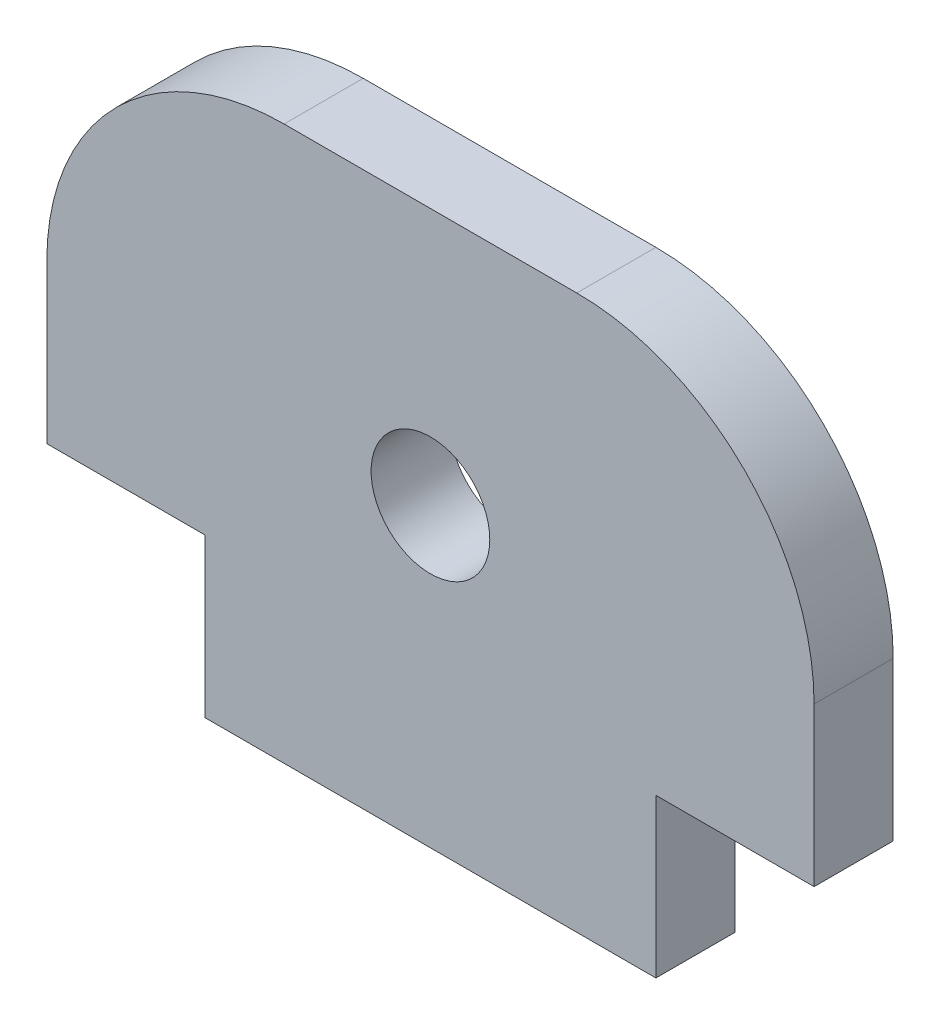
ISO-10303-21;
HEADER;
FILE_DESCRIPTION(('STEP AP214'),'2;1');
FILE_NAME('part.step','',(''),(''),'','','');
FILE_SCHEMA(('AUTOMOTIVE_DESIGN { 1 0 10303 214 1 1 1 1 }'));
ENDSEC;
DATA;
#1=APPLICATION_CONTEXT('core data for automotive mechanical design processes');
#2=APPLICATION_PROTOCOL_DEFINITION('international standard','automotive_design',2000,#1);
#3=PRODUCT_CONTEXT('',#1,'mechanical');
#4=PRODUCT('Part','Part','',(#3));
#5=PRODUCT_RELATED_PRODUCT_CATEGORY('part','',(#4));
#6=PRODUCT_DEFINITION_FORMATION('','',#4);
#7=PRODUCT_DEFINITION_CONTEXT('part definition',#1,'design');
#8=PRODUCT_DEFINITION('design','',#6,#7);
#9=PRODUCT_DEFINITION_SHAPE('','',#8);
#10=(LENGTH_UNIT() NAMED_UNIT(*) SI_UNIT(.MILLI.,.METRE.));
#11=(NAMED_UNIT(*) PLANE_ANGLE_UNIT() SI_UNIT($,.RADIAN.));
#12=(NAMED_UNIT(*) SI_UNIT($,.STERADIAN.) SOLID_ANGLE_UNIT());
#13=UNCERTAINTY_MEASURE_WITH_UNIT(LENGTH_MEASURE(1.E-05),#10,'distance_accuracy_value','');
#14=(GEOMETRIC_REPRESENTATION_CONTEXT(3) GLOBAL_UNCERTAINTY_ASSIGNED_CONTEXT((#13)) GLOBAL_UNIT_ASSIGNED_CONTEXT((#10,
#11,#12)) REPRESENTATION_CONTEXT('',''));
#15=CARTESIAN_POINT('',(0.,0.,0.));
#16=DIRECTION('',(0.,0.,1.));
#17=DIRECTION('',(1.,0.,0.));
#18=AXIS2_PLACEMENT_3D('',#15,#16,#17);
#19=CARTESIAN_POINT('',(3.70000000000026,0.499999999999501,2.));
#20=DIRECTION('',(0.,0.,1.));
#21=DIRECTION('',(1.,0.,0.));
#22=AXIS2_PLACEMENT_3D('',#19,#20,#21);
#23=PLANE('',#22);
#24=CARTESIAN_POINT('',(3.70000000000026,0.499999999999501,2.));
#25=DIRECTION('',(0.,0.,1.));
#26=DIRECTION('',(1.,0.,0.));
#27=AXIS2_PLACEMENT_3D('',#24,#25,#26);
#28=CIRCLE('',#27,5.99999999999989);
#29=CARTESIAN_POINT('',(9.70000000000015,0.499999999999501,2.));
#30=VERTEX_POINT('',#29);
#31=CARTESIAN_POINT('',(3.70000000000026,6.4999999999994,2.));
#32=VERTEX_POINT('',#31);
#33=EDGE_CURVE('E160',#30,#32,#28,.T.);
#34=ORIENTED_EDGE('',*,*,#33,.T.);
#35=DIRECTION('',(-1.,0.,0.));
#36=VECTOR('',#35,1.);
#37=CARTESIAN_POINT('',(-3.7000000000007,6.49999999999951,2.));
#38=LINE('',#37,#36);
#39=CARTESIAN_POINT('',(-3.7000000000007,6.4999999999994,2.));
#40=VERTEX_POINT('',#39);
#41=EDGE_CURVE('E98',#32,#40,#38,.T.);
#42=ORIENTED_EDGE('',*,*,#41,.T.);
#43=CARTESIAN_POINT('',(-3.7000000000007,0.499999999999501,2.));
#44=DIRECTION('',(0.,0.,1.));
#45=DIRECTION('',(1.,0.,0.));
#46=AXIS2_PLACEMENT_3D('',#43,#44,#45);
#47=CIRCLE('',#46,5.99999999999989);
#48=CARTESIAN_POINT('',(-9.70000000000049,0.499999999999501,2.));
#49=VERTEX_POINT('',#48);
#50=EDGE_CURVE('E181',#40,#49,#47,.T.);
#51=ORIENTED_EDGE('',*,*,#50,.T.);
#52=DIRECTION('',(0.,-1.,0.));
#53=VECTOR('',#52,1.);
#54=CARTESIAN_POINT('',(-9.70000000000049,-3.5000000000005,2.));
#55=LINE('',#54,#53);
#56=CARTESIAN_POINT('',(-9.70000000000049,-3.5000000000005,2.));
#57=VERTEX_POINT('',#56);
#58=EDGE_CURVE('E200',#49,#57,#55,.T.);
#59=ORIENTED_EDGE('',*,*,#58,.T.);
#60=DIRECTION('',(1.,0.,0.));
#61=VECTOR('',#60,1.);
#62=CARTESIAN_POINT('',(-9.70000000000049,-3.5000000000005,2.));
#63=LINE('',#62,#61);
#64=CARTESIAN_POINT('',(-5.70000000000048,-3.5000000000005,2.));
#65=VERTEX_POINT('',#64);
#66=EDGE_CURVE('E197',#57,#65,#63,.T.);
#67=ORIENTED_EDGE('',*,*,#66,.T.);
#68=DIRECTION('',(0.,-1.,0.));
#69=VECTOR('',#68,1.);
#70=CARTESIAN_POINT('',(-5.70000000000048,-7.50000000000051,2.));
#71=LINE('',#70,#69);
#72=CARTESIAN_POINT('',(-5.70000000000048,-7.50000000000051,2.));
#73=VERTEX_POINT('',#72);
#74=EDGE_CURVE('E199',#65,#73,#71,.T.);
#75=ORIENTED_EDGE('',*,*,#74,.T.);
#76=DIRECTION('',(1.,0.,0.));
#77=VECTOR('',#76,1.);
#78=CARTESIAN_POINT('',(5.70000000000004,-7.50000000000051,2.));
#79=LINE('',#78,#77);
#80=CARTESIAN_POINT('',(5.70000000000004,-7.50000000000051,2.));
#81=VERTEX_POINT('',#80);
#82=EDGE_CURVE('E123',#73,#81,#79,.T.);
#83=ORIENTED_EDGE('',*,*,#82,.T.);
#84=DIRECTION('',(0.,1.,0.));
#85=VECTOR('',#84,1.);
#86=CARTESIAN_POINT('',(5.70000000000004,-3.5000000000005,2.));
#87=LINE('',#86,#85);
#88=CARTESIAN_POINT('',(5.70000000000004,-3.5000000000005,2.));
#89=VERTEX_POINT('',#88);
#90=EDGE_CURVE('E117',#81,#89,#87,.T.);
#91=ORIENTED_EDGE('',*,*,#90,.T.);
#92=DIRECTION('',(1.,0.,0.));
#93=VECTOR('',#92,1.);
#94=CARTESIAN_POINT('',(9.70000000000015,-3.5000000000005,2.));
#95=LINE('',#94,#93);
#96=CARTESIAN_POINT('',(9.70000000000015,-3.5000000000005,2.));
#97=VERTEX_POINT('',#96);
#98=EDGE_CURVE('E121',#89,#97,#95,.T.);
#99=ORIENTED_EDGE('',*,*,#98,.T.);
#100=DIRECTION('',(0.,1.,0.));
#101=VECTOR('',#100,1.);
#102=CARTESIAN_POINT('',(9.70000000000015,-3.5000000000005,2.));
#103=LINE('',#102,#101);
#104=EDGE_CURVE('E49',#97,#30,#103,.T.);
#105=ORIENTED_EDGE('',*,*,#104,.T.);
#106=EDGE_LOOP('',(#34,#42,#51,#59,#67,#75,#83,#91,#99,#105));
#107=FACE_BOUND('',#106,.T.);
#108=CARTESIAN_POINT('',(0.,0.,2.));
#109=DIRECTION('',(0.,0.,1.));
#110=DIRECTION('',(1.,0.,0.));
#111=AXIS2_PLACEMENT_3D('',#108,#109,#110);
#112=CIRCLE('',#111,1.50000000000006);
#113=CARTESIAN_POINT('',(1.50000000000006,0.,2.));
#114=VERTEX_POINT('',#113);
#115=EDGE_CURVE('E145',#114,#114,#112,.T.);
#116=ORIENTED_EDGE('',*,*,#115,.F.);
#117=EDGE_LOOP('',(#116));
#118=FACE_BOUND('',#117,.T.);
#119=ADVANCED_FACE('F32',(#107,#118),#23,.T.);
#120=CARTESIAN_POINT('',(3.70000000000026,0.499999999999501,0.));
#121=DIRECTION('',(0.,0.,1.));
#122=DIRECTION('',(1.,0.,0.));
#123=AXIS2_PLACEMENT_3D('',#120,#121,#122);
#124=PLANE('',#123);
#125=CARTESIAN_POINT('',(3.70000000000026,0.499999999999501,0.));
#126=DIRECTION('',(0.,0.,1.));
#127=DIRECTION('',(1.,0.,0.));
#128=AXIS2_PLACEMENT_3D('',#125,#126,#127);
#129=CIRCLE('',#128,5.99999999999989);
#130=CARTESIAN_POINT('',(9.70000000000015,0.499999999999501,0.));
#131=VERTEX_POINT('',#130);
#132=CARTESIAN_POINT('',(3.70000000000026,6.4999999999994,0.));
#133=VERTEX_POINT('',#132);
#134=EDGE_CURVE('E141',#131,#133,#129,.T.);
#135=ORIENTED_EDGE('',*,*,#134,.F.);
#136=DIRECTION('',(0.,1.,0.));
#137=VECTOR('',#136,1.);
#138=CARTESIAN_POINT('',(9.70000000000015,-3.5000000000005,0.));
#139=LINE('',#138,#137);
#140=CARTESIAN_POINT('',(9.70000000000015,-3.5000000000005,0.));
#141=VERTEX_POINT('',#140);
#142=EDGE_CURVE('E90',#141,#131,#139,.T.);
#143=ORIENTED_EDGE('',*,*,#142,.F.);
#144=DIRECTION('',(1.,0.,0.));
#145=VECTOR('',#144,1.);
#146=CARTESIAN_POINT('',(9.70000000000015,-3.5000000000005,0.));
#147=LINE('',#146,#145);
#148=CARTESIAN_POINT('',(5.70000000000004,-3.5000000000005,0.));
#149=VERTEX_POINT('',#148);
#150=EDGE_CURVE('E84',#149,#141,#147,.T.);
#151=ORIENTED_EDGE('',*,*,#150,.F.);
#152=DIRECTION('',(0.,1.,0.));
#153=VECTOR('',#152,1.);
#154=CARTESIAN_POINT('',(5.70000000000004,-3.5000000000005,0.));
#155=LINE('',#154,#153);
#156=CARTESIAN_POINT('',(5.70000000000004,-7.50000000000051,0.));
#157=VERTEX_POINT('',#156);
#158=EDGE_CURVE('E131',#157,#149,#155,.T.);
#159=ORIENTED_EDGE('',*,*,#158,.F.);
#160=DIRECTION('',(1.,0.,0.));
#161=VECTOR('',#160,1.);
#162=CARTESIAN_POINT('',(5.70000000000004,-7.50000000000051,0.));
#163=LINE('',#162,#161);
#164=CARTESIAN_POINT('',(-5.70000000000048,-7.50000000000051,0.));
#165=VERTEX_POINT('',#164);
#166=EDGE_CURVE('E155',#165,#157,#163,.T.);
#167=ORIENTED_EDGE('',*,*,#166,.F.);
#168=DIRECTION('',(0.,-1.,0.));
#169=VECTOR('',#168,1.);
#170=CARTESIAN_POINT('',(-5.70000000000048,-7.50000000000051,0.));
#171=LINE('',#170,#169);
#172=CARTESIAN_POINT('',(-5.70000000000048,-3.5000000000005,0.));
#173=VERTEX_POINT('',#172);
#174=EDGE_CURVE('E153',#173,#165,#171,.T.);
#175=ORIENTED_EDGE('',*,*,#174,.F.);
#176=DIRECTION('',(1.,0.,0.));
#177=VECTOR('',#176,1.);
#178=CARTESIAN_POINT('',(-9.70000000000049,-3.5000000000005,0.));
#179=LINE('',#178,#177);
#180=CARTESIAN_POINT('',(-9.70000000000049,-3.5000000000005,0.));
#181=VERTEX_POINT('',#180);
#182=EDGE_CURVE('E151',#181,#173,#179,.T.);
#183=ORIENTED_EDGE('',*,*,#182,.F.);
#184=DIRECTION('',(0.,-1.,0.));
#185=VECTOR('',#184,1.);
#186=CARTESIAN_POINT('',(-9.70000000000049,-3.5000000000005,0.));
#187=LINE('',#186,#185);
#188=CARTESIAN_POINT('',(-9.70000000000049,0.499999999999501,0.));
#189=VERTEX_POINT('',#188);
#190=EDGE_CURVE('E149',#189,#181,#187,.T.);
#191=ORIENTED_EDGE('',*,*,#190,.F.);
#192=CARTESIAN_POINT('',(-3.7000000000007,0.499999999999501,0.));
#193=DIRECTION('',(0.,0.,1.));
#194=DIRECTION('',(1.,0.,0.));
#195=AXIS2_PLACEMENT_3D('',#192,#193,#194);
#196=CIRCLE('',#195,5.99999999999989);
#197=CARTESIAN_POINT('',(-3.7000000000007,6.4999999999994,0.));
#198=VERTEX_POINT('',#197);
#199=EDGE_CURVE('E147',#198,#189,#196,.T.);
#200=ORIENTED_EDGE('',*,*,#199,.F.);
#201=DIRECTION('',(-1.,0.,0.));
#202=VECTOR('',#201,1.);
#203=CARTESIAN_POINT('',(-3.7000000000007,6.49999999999951,0.));
#204=LINE('',#203,#202);
#205=EDGE_CURVE('E144',#133,#198,#204,.T.);
#206=ORIENTED_EDGE('',*,*,#205,.F.);
#207=EDGE_LOOP('',(#135,#143,#151,#159,#167,#175,#183,#191,#200,#206));
#208=FACE_BOUND('',#207,.T.);
#209=CARTESIAN_POINT('',(0.,0.,0.));
#210=DIRECTION('',(0.,0.,1.));
#211=DIRECTION('',(1.,0.,0.));
#212=AXIS2_PLACEMENT_3D('',#209,#210,#211);
#213=CIRCLE('',#212,1.50000000000006);
#214=CARTESIAN_POINT('',(1.50000000000006,0.,0.));
#215=VERTEX_POINT('',#214);
#216=EDGE_CURVE('E208',#215,#215,#213,.T.);
#217=ORIENTED_EDGE('',*,*,#216,.T.);
#218=EDGE_LOOP('',(#217));
#219=FACE_BOUND('',#218,.T.);
#220=ADVANCED_FACE('F185',(#208,#219),#124,.F.);
#221=CARTESIAN_POINT('',(3.70000000000026,0.499999999999501,2.));
#222=DIRECTION('',(0.,0.,-1.));
#223=DIRECTION('',(-1.,0.,0.));
#224=AXIS2_PLACEMENT_3D('',#221,#222,#223);
#225=CYLINDRICAL_SURFACE('',#224,5.99999999999989);
#226=ORIENTED_EDGE('',*,*,#134,.T.);
#227=DIRECTION('',(0.,0.,-1.));
#228=VECTOR('',#227,1.);
#229=CARTESIAN_POINT('',(3.70000000000026,6.4999999999994,2.));
#230=LINE('',#229,#228);
#231=EDGE_CURVE('E11',#32,#133,#230,.T.);
#232=ORIENTED_EDGE('',*,*,#231,.F.);
#233=ORIENTED_EDGE('',*,*,#33,.F.);
#234=DIRECTION('',(0.,0.,-1.));
#235=VECTOR('',#234,1.);
#236=CARTESIAN_POINT('',(9.70000000000015,0.499999999999501,2.));
#237=LINE('',#236,#235);
#238=EDGE_CURVE('E137',#30,#131,#237,.T.);
#239=ORIENTED_EDGE('',*,*,#238,.T.);
#240=EDGE_LOOP('',(#226,#232,#233,#239));
#241=FACE_BOUND('',#240,.T.);
#242=ADVANCED_FACE('F34',(#241),#225,.T.);
#243=CARTESIAN_POINT('',(-3.7000000000007,6.49999999999951,2.));
#244=DIRECTION('',(0.,-1.,0.));
#245=DIRECTION('',(1.,0.,0.));
#246=AXIS2_PLACEMENT_3D('',#243,#244,#245);
#247=PLANE('',#246);
#248=ORIENTED_EDGE('',*,*,#205,.T.);
#249=DIRECTION('',(0.,0.,-1.));
#250=VECTOR('',#249,1.);
#251=CARTESIAN_POINT('',(-3.7000000000007,6.4999999999994,2.));
#252=LINE('',#251,#250);
#253=EDGE_CURVE('E41',#40,#198,#252,.T.);
#254=ORIENTED_EDGE('',*,*,#253,.F.);
#255=ORIENTED_EDGE('',*,*,#41,.F.);
#256=ORIENTED_EDGE('',*,*,#231,.T.);
#257=EDGE_LOOP('',(#248,#254,#255,#256));
#258=FACE_BOUND('',#257,.T.);
#259=ADVANCED_FACE('F244',(#258),#247,.F.);
#260=CARTESIAN_POINT('',(-3.7000000000007,0.499999999999501,2.));
#261=DIRECTION('',(0.,0.,-1.));
#262=DIRECTION('',(-1.,0.,0.));
#263=AXIS2_PLACEMENT_3D('',#260,#261,#262);
#264=CYLINDRICAL_SURFACE('',#263,5.99999999999989);
#265=ORIENTED_EDGE('',*,*,#199,.T.);
#266=DIRECTION('',(0.,0.,-1.));
#267=VECTOR('',#266,1.);
#268=CARTESIAN_POINT('',(-9.70000000000049,0.499999999999501,2.));
#269=LINE('',#268,#267);
#270=EDGE_CURVE('E173',#49,#189,#269,.T.);
#271=ORIENTED_EDGE('',*,*,#270,.F.);
#272=ORIENTED_EDGE('',*,*,#50,.F.);
#273=ORIENTED_EDGE('',*,*,#253,.T.);
#274=EDGE_LOOP('',(#265,#271,#272,#273));
#275=FACE_BOUND('',#274,.T.);
#276=ADVANCED_FACE('F179',(#275),#264,.T.);
#277=CARTESIAN_POINT('',(-9.70000000000049,-3.5000000000005,2.));
#278=DIRECTION('',(1.,0.,0.));
#279=DIRECTION('',(0.,0.,-1.));
#280=AXIS2_PLACEMENT_3D('',#277,#278,#279);
#281=PLANE('',#280);
#282=ORIENTED_EDGE('',*,*,#190,.T.);
#283=DIRECTION('',(0.,0.,-1.));
#284=VECTOR('',#283,1.);
#285=CARTESIAN_POINT('',(-9.70000000000049,-3.5000000000005,2.));
#286=LINE('',#285,#284);
#287=EDGE_CURVE('E170',#57,#181,#286,.T.);
#288=ORIENTED_EDGE('',*,*,#287,.F.);
#289=ORIENTED_EDGE('',*,*,#58,.F.);
#290=ORIENTED_EDGE('',*,*,#270,.T.);
#291=EDGE_LOOP('',(#282,#288,#289,#290));
#292=FACE_BOUND('',#291,.T.);
#293=ADVANCED_FACE('F191',(#292),#281,.F.);
#294=CARTESIAN_POINT('',(-9.70000000000049,-3.5000000000005,2.));
#295=DIRECTION('',(0.,1.,0.));
#296=DIRECTION('',(0.,0.,1.));
#297=AXIS2_PLACEMENT_3D('',#294,#295,#296);
#298=PLANE('',#297);
#299=ORIENTED_EDGE('',*,*,#182,.T.);
#300=DIRECTION('',(0.,0.,-1.));
#301=VECTOR('',#300,1.);
#302=CARTESIAN_POINT('',(-5.70000000000048,-3.5000000000005,2.));
#303=LINE('',#302,#301);
#304=EDGE_CURVE('E167',#65,#173,#303,.T.);
#305=ORIENTED_EDGE('',*,*,#304,.F.);
#306=ORIENTED_EDGE('',*,*,#66,.F.);
#307=ORIENTED_EDGE('',*,*,#287,.T.);
#308=EDGE_LOOP('',(#299,#305,#306,#307));
#309=FACE_BOUND('',#308,.T.);
#310=ADVANCED_FACE('F195',(#309),#298,.F.);
#311=CARTESIAN_POINT('',(-5.70000000000048,-7.50000000000051,2.));
#312=DIRECTION('',(1.,0.,0.));
#313=DIRECTION('',(0.,0.,-1.));
#314=AXIS2_PLACEMENT_3D('',#311,#312,#313);
#315=PLANE('',#314);
#316=ORIENTED_EDGE('',*,*,#174,.T.);
#317=DIRECTION('',(0.,0.,-1.));
#318=VECTOR('',#317,1.);
#319=CARTESIAN_POINT('',(-5.70000000000048,-7.50000000000051,2.));
#320=LINE('',#319,#318);
#321=EDGE_CURVE('E164',#73,#165,#320,.T.);
#322=ORIENTED_EDGE('',*,*,#321,.F.);
#323=ORIENTED_EDGE('',*,*,#74,.F.);
#324=ORIENTED_EDGE('',*,*,#304,.T.);
#325=EDGE_LOOP('',(#316,#322,#323,#324));
#326=FACE_BOUND('',#325,.T.);
#327=ADVANCED_FACE('F234',(#326),#315,.F.);
#328=CARTESIAN_POINT('',(5.70000000000004,-7.50000000000051,2.));
#329=DIRECTION('',(0.,1.,0.));
#330=DIRECTION('',(0.,0.,1.));
#331=AXIS2_PLACEMENT_3D('',#328,#329,#330);
#332=PLANE('',#331);
#333=ORIENTED_EDGE('',*,*,#166,.T.);
#334=DIRECTION('',(0.,0.,-1.));
#335=VECTOR('',#334,1.);
#336=CARTESIAN_POINT('',(5.70000000000004,-7.50000000000051,2.));
#337=LINE('',#336,#335);
#338=EDGE_CURVE('E132',#81,#157,#337,.T.);
#339=ORIENTED_EDGE('',*,*,#338,.F.);
#340=ORIENTED_EDGE('',*,*,#82,.F.);
#341=ORIENTED_EDGE('',*,*,#321,.T.);
#342=EDGE_LOOP('',(#333,#339,#340,#341));
#343=FACE_BOUND('',#342,.T.);
#344=ADVANCED_FACE('F231',(#343),#332,.F.);
#345=CARTESIAN_POINT('',(5.70000000000004,-3.5000000000005,2.));
#346=DIRECTION('',(-1.,0.,0.));
#347=DIRECTION('',(0.,0.,1.));
#348=AXIS2_PLACEMENT_3D('',#345,#346,#347);
#349=PLANE('',#348);
#350=ORIENTED_EDGE('',*,*,#158,.T.);
#351=DIRECTION('',(0.,0.,-1.));
#352=VECTOR('',#351,1.);
#353=CARTESIAN_POINT('',(5.70000000000004,-3.5000000000005,2.));
#354=LINE('',#353,#352);
#355=EDGE_CURVE('E128',#89,#149,#354,.T.);
#356=ORIENTED_EDGE('',*,*,#355,.F.);
#357=ORIENTED_EDGE('',*,*,#90,.F.);
#358=ORIENTED_EDGE('',*,*,#338,.T.);
#359=EDGE_LOOP('',(#350,#356,#357,#358));
#360=FACE_BOUND('',#359,.T.);
#361=ADVANCED_FACE('F129',(#360),#349,.F.);
#362=CARTESIAN_POINT('',(9.70000000000015,-3.5000000000005,2.));
#363=DIRECTION('',(0.,1.,0.));
#364=DIRECTION('',(0.,0.,1.));
#365=AXIS2_PLACEMENT_3D('',#362,#363,#364);
#366=PLANE('',#365);
#367=ORIENTED_EDGE('',*,*,#150,.T.);
#368=DIRECTION('',(0.,0.,-1.));
#369=VECTOR('',#368,1.);
#370=CARTESIAN_POINT('',(9.70000000000015,-3.5000000000005,2.));
#371=LINE('',#370,#369);
#372=EDGE_CURVE('E133',#97,#141,#371,.T.);
#373=ORIENTED_EDGE('',*,*,#372,.F.);
#374=ORIENTED_EDGE('',*,*,#98,.F.);
#375=ORIENTED_EDGE('',*,*,#355,.T.);
#376=EDGE_LOOP('',(#367,#373,#374,#375));
#377=FACE_BOUND('',#376,.T.);
#378=ADVANCED_FACE('F135',(#377),#366,.F.);
#379=CARTESIAN_POINT('',(9.70000000000015,-3.5000000000005,2.));
#380=DIRECTION('',(-1.,0.,0.));
#381=DIRECTION('',(0.,0.,1.));
#382=AXIS2_PLACEMENT_3D('',#379,#380,#381);
#383=PLANE('',#382);
#384=ORIENTED_EDGE('',*,*,#142,.T.);
#385=ORIENTED_EDGE('',*,*,#238,.F.);
#386=ORIENTED_EDGE('',*,*,#104,.F.);
#387=ORIENTED_EDGE('',*,*,#372,.T.);
#388=EDGE_LOOP('',(#384,#385,#386,#387));
#389=FACE_BOUND('',#388,.T.);
#390=ADVANCED_FACE('F224',(#389),#383,.F.);
#391=CARTESIAN_POINT('',(0.,0.,2.));
#392=DIRECTION('',(0.,0.,-1.));
#393=DIRECTION('',(-1.,0.,0.));
#394=AXIS2_PLACEMENT_3D('',#391,#392,#393);
#395=CYLINDRICAL_SURFACE('',#394,1.50000000000006);
#396=ORIENTED_EDGE('',*,*,#115,.T.);
#397=EDGE_LOOP('',(#396));
#398=FACE_BOUND('',#397,.T.);
#399=ORIENTED_EDGE('',*,*,#216,.F.);
#400=EDGE_LOOP('',(#399));
#401=FACE_BOUND('',#400,.T.);
#402=ADVANCED_FACE('F214',(#398,#401),#395,.F.);
#403=CLOSED_SHELL('',(#119,#220,#242,#259,#276,#293,#310,#327,#344,#361,#378,#390,#402));
#404=MANIFOLD_SOLID_BREP('B2',#403);
#405=ADVANCED_BREP_SHAPE_REPRESENTATION('',(#18,#404),#14);
#406=SHAPE_DEFINITION_REPRESENTATION(#9,#405);
ENDSEC;
END-ISO-10303-21;
